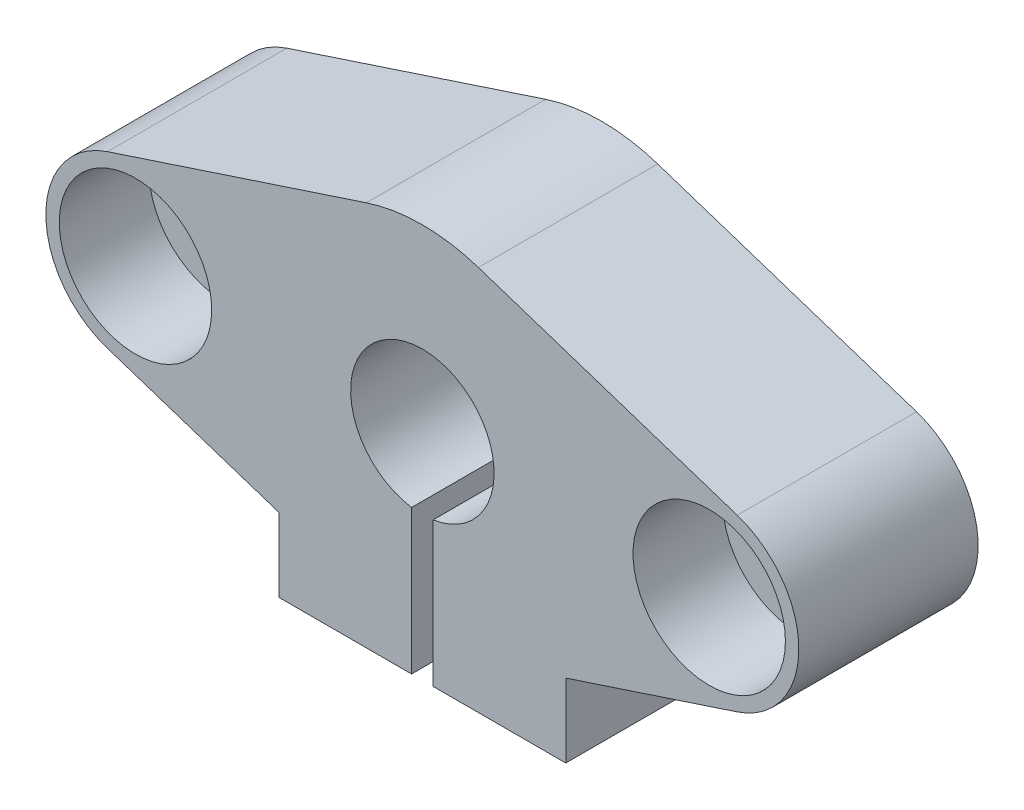
ISO-10303-21;
HEADER;
FILE_DESCRIPTION(('STEP AP214'),'2;1');
FILE_NAME('part.step','',(''),(''),'','','');
FILE_SCHEMA(('AUTOMOTIVE_DESIGN { 1 0 10303 214 1 1 1 1 }'));
ENDSEC;
DATA;
#1=APPLICATION_CONTEXT('core data for automotive mechanical design processes');
#2=APPLICATION_PROTOCOL_DEFINITION('international standard','automotive_design',2000,#1);
#3=PRODUCT_CONTEXT('',#1,'mechanical');
#4=PRODUCT('Part','Part','',(#3));
#5=PRODUCT_RELATED_PRODUCT_CATEGORY('part','',(#4));
#6=PRODUCT_DEFINITION_FORMATION('','',#4);
#7=PRODUCT_DEFINITION_CONTEXT('part definition',#1,'design');
#8=PRODUCT_DEFINITION('design','',#6,#7);
#9=PRODUCT_DEFINITION_SHAPE('','',#8);
#10=(LENGTH_UNIT() NAMED_UNIT(*) SI_UNIT(.MILLI.,.METRE.));
#11=(NAMED_UNIT(*) PLANE_ANGLE_UNIT() SI_UNIT($,.RADIAN.));
#12=(NAMED_UNIT(*) SI_UNIT($,.STERADIAN.) SOLID_ANGLE_UNIT());
#13=UNCERTAINTY_MEASURE_WITH_UNIT(LENGTH_MEASURE(1.E-05),#10,'distance_accuracy_value','');
#14=(GEOMETRIC_REPRESENTATION_CONTEXT(3) GLOBAL_UNCERTAINTY_ASSIGNED_CONTEXT((#13)) GLOBAL_UNIT_ASSIGNED_CONTEXT((#10,
#11,#12)) REPRESENTATION_CONTEXT('',''));
#15=CARTESIAN_POINT('',(0.,0.,0.));
#16=DIRECTION('',(0.,0.,1.));
#17=DIRECTION('',(1.,0.,0.));
#18=AXIS2_PLACEMENT_3D('',#15,#16,#17);
#19=CARTESIAN_POINT('',(0.,0.,5.));
#20=DIRECTION('',(0.,0.,1.));
#21=DIRECTION('',(1.,0.,0.));
#22=AXIS2_PLACEMENT_3D('',#19,#20,#21);
#23=PLANE('',#22);
#24=CARTESIAN_POINT('',(16.,0.,5.));
#25=DIRECTION('',(0.,0.,1.));
#26=DIRECTION('',(-1.,0.,0.));
#27=AXIS2_PLACEMENT_3D('',#24,#25,#26);
#28=CIRCLE('',#27,2.75);
#29=CARTESIAN_POINT('',(13.25,0.,5.));
#30=VERTEX_POINT('',#29);
#31=EDGE_CURVE('E369',#30,#30,#28,.T.);
#32=ORIENTED_EDGE('',*,*,#31,.F.);
#33=EDGE_LOOP('',(#32));
#34=FACE_BOUND('',#33,.T.);
#35=CARTESIAN_POINT('',(16.,0.,5.));
#36=DIRECTION('',(0.,0.,1.));
#37=DIRECTION('',(1.,0.,0.));
#38=AXIS2_PLACEMENT_3D('',#35,#36,#37);
#39=CIRCLE('',#38,4.25);
#40=CARTESIAN_POINT('',(20.25,0.,5.));
#41=VERTEX_POINT('',#40);
#42=EDGE_CURVE('E12',#41,#41,#39,.F.);
#43=ORIENTED_EDGE('',*,*,#42,.F.);
#44=EDGE_LOOP('',(#43));
#45=FACE_BOUND('',#44,.T.);
#46=ADVANCED_FACE('F111',(#34,#45),#23,.T.);
#47=CARTESIAN_POINT('',(8.,-6.00000000000001,10.));
#48=DIRECTION('',(1.,0.,0.));
#49=DIRECTION('',(0.,0.,-1.));
#50=AXIS2_PLACEMENT_3D('',#47,#48,#49);
#51=PLANE('',#50);
#52=DIRECTION('',(0.,0.,1.));
#53=VECTOR('',#52,1.);
#54=CARTESIAN_POINT('',(8.,-7.89542033951723,5.));
#55=LINE('',#54,#53);
#56=CARTESIAN_POINT('',(8.,-7.89542033951723,0.));
#57=VERTEX_POINT('',#56);
#58=CARTESIAN_POINT('',(8.,-7.89542033951723,10.));
#59=VERTEX_POINT('',#58);
#60=EDGE_CURVE('E127',#57,#59,#55,.T.);
#61=ORIENTED_EDGE('',*,*,#60,.T.);
#62=DIRECTION('',(0.,-1.,0.));
#63=VECTOR('',#62,1.);
#64=CARTESIAN_POINT('',(8.,-6.00000000000001,10.));
#65=LINE('',#64,#63);
#66=CARTESIAN_POINT('',(8.,-12.,10.));
#67=VERTEX_POINT('',#66);
#68=EDGE_CURVE('E235',#59,#67,#65,.T.);
#69=ORIENTED_EDGE('',*,*,#68,.T.);
#70=DIRECTION('',(0.,0.,-1.));
#71=VECTOR('',#70,1.);
#72=CARTESIAN_POINT('',(8.,-12.,10.));
#73=LINE('',#72,#71);
#74=CARTESIAN_POINT('',(8.,-12.,0.));
#75=VERTEX_POINT('',#74);
#76=EDGE_CURVE('E303',#67,#75,#73,.T.);
#77=ORIENTED_EDGE('',*,*,#76,.T.);
#78=DIRECTION('',(0.,-1.,0.));
#79=VECTOR('',#78,1.);
#80=CARTESIAN_POINT('',(8.,-6.00000000000001,0.));
#81=LINE('',#80,#79);
#82=EDGE_CURVE('E296',#57,#75,#81,.T.);
#83=ORIENTED_EDGE('',*,*,#82,.F.);
#84=EDGE_LOOP('',(#61,#69,#77,#83));
#85=FACE_BOUND('',#84,.T.);
#86=ADVANCED_FACE('F408',(#85),#51,.T.);
#87=CARTESIAN_POINT('',(0.,0.,10.));
#88=DIRECTION('',(0.,0.,-1.));
#89=DIRECTION('',(-1.,0.,0.));
#90=AXIS2_PLACEMENT_3D('',#87,#88,#89);
#91=CYLINDRICAL_SURFACE('',#90,10.);
#92=CARTESIAN_POINT('',(0.,0.,10.));
#93=DIRECTION('',(0.,0.,1.));
#94=DIRECTION('',(1.,0.,0.));
#95=AXIS2_PLACEMENT_3D('',#92,#93,#94);
#96=CIRCLE('',#95,10.);
#97=CARTESIAN_POINT('',(3.125,9.49917759598166,10.));
#98=VERTEX_POINT('',#97);
#99=CARTESIAN_POINT('',(-3.125,9.49917759598166,10.));
#100=VERTEX_POINT('',#99);
#101=EDGE_CURVE('E135',#98,#100,#96,.T.);
#102=ORIENTED_EDGE('',*,*,#101,.F.);
#103=DIRECTION('',(0.,0.,-1.));
#104=VECTOR('',#103,1.);
#105=CARTESIAN_POINT('',(3.125,9.49917759598166,5.));
#106=LINE('',#105,#104);
#107=CARTESIAN_POINT('',(3.125,9.49917759598166,0.));
#108=VERTEX_POINT('',#107);
#109=EDGE_CURVE('E227',#98,#108,#106,.T.);
#110=ORIENTED_EDGE('',*,*,#109,.T.);
#111=CARTESIAN_POINT('',(0.,0.,0.));
#112=DIRECTION('',(0.,0.,1.));
#113=DIRECTION('',(1.,0.,0.));
#114=AXIS2_PLACEMENT_3D('',#111,#112,#113);
#115=CIRCLE('',#114,10.);
#116=CARTESIAN_POINT('',(-3.125,9.49917759598166,0.));
#117=VERTEX_POINT('',#116);
#118=EDGE_CURVE('E346',#108,#117,#115,.T.);
#119=ORIENTED_EDGE('',*,*,#118,.T.);
#120=DIRECTION('',(0.,0.,-1.));
#121=VECTOR('',#120,1.);
#122=CARTESIAN_POINT('',(-3.125,9.49917759598166,5.));
#123=LINE('',#122,#121);
#124=EDGE_CURVE('E350',#100,#117,#123,.T.);
#125=ORIENTED_EDGE('',*,*,#124,.F.);
#126=EDGE_LOOP('',(#102,#110,#119,#125));
#127=FACE_BOUND('',#126,.T.);
#128=ADVANCED_FACE('F113',(#127),#91,.T.);
#129=CARTESIAN_POINT('',(0.,0.,5.));
#130=DIRECTION('',(0.,0.,1.));
#131=DIRECTION('',(1.,0.,0.));
#132=AXIS2_PLACEMENT_3D('',#129,#130,#131);
#133=PLANE('',#132);
#134=CARTESIAN_POINT('',(-16.,0.,5.));
#135=DIRECTION('',(0.,0.,1.));
#136=DIRECTION('',(1.,0.,0.));
#137=AXIS2_PLACEMENT_3D('',#134,#135,#136);
#138=CIRCLE('',#137,2.75);
#139=CARTESIAN_POINT('',(-13.25,0.,5.));
#140=VERTEX_POINT('',#139);
#141=EDGE_CURVE('E360',#140,#140,#138,.T.);
#142=ORIENTED_EDGE('',*,*,#141,.F.);
#143=EDGE_LOOP('',(#142));
#144=FACE_BOUND('',#143,.T.);
#145=CARTESIAN_POINT('',(-16.,0.,5.));
#146=DIRECTION('',(0.,0.,1.));
#147=DIRECTION('',(1.,0.,0.));
#148=AXIS2_PLACEMENT_3D('',#145,#146,#147);
#149=CIRCLE('',#148,4.25);
#150=CARTESIAN_POINT('',(-11.75,0.,5.));
#151=VERTEX_POINT('',#150);
#152=EDGE_CURVE('E120',#151,#151,#149,.F.);
#153=ORIENTED_EDGE('',*,*,#152,.F.);
#154=EDGE_LOOP('',(#153));
#155=FACE_BOUND('',#154,.T.);
#156=ADVANCED_FACE('F395',(#144,#155),#133,.T.);
#157=CARTESIAN_POINT('',(-8.,-6.00000000000001,10.));
#158=DIRECTION('',(1.,0.,0.));
#159=DIRECTION('',(0.,0.,-1.));
#160=AXIS2_PLACEMENT_3D('',#157,#158,#159);
#161=PLANE('',#160);
#162=DIRECTION('',(0.,-1.,0.));
#163=VECTOR('',#162,1.);
#164=CARTESIAN_POINT('',(-8.,-6.00000000000001,10.));
#165=LINE('',#164,#163);
#166=CARTESIAN_POINT('',(-8.,-7.89542033951723,10.));
#167=VERTEX_POINT('',#166);
#168=CARTESIAN_POINT('',(-8.,-12.,10.));
#169=VERTEX_POINT('',#168);
#170=EDGE_CURVE('E292',#167,#169,#165,.T.);
#171=ORIENTED_EDGE('',*,*,#170,.F.);
#172=DIRECTION('',(0.,0.,-1.));
#173=VECTOR('',#172,1.);
#174=CARTESIAN_POINT('',(-8.,-7.89542033951723,5.));
#175=LINE('',#174,#173);
#176=CARTESIAN_POINT('',(-8.,-7.89542033951723,0.));
#177=VERTEX_POINT('',#176);
#178=EDGE_CURVE('E387',#167,#177,#175,.T.);
#179=ORIENTED_EDGE('',*,*,#178,.T.);
#180=DIRECTION('',(0.,-1.,0.));
#181=VECTOR('',#180,1.);
#182=CARTESIAN_POINT('',(-8.,-6.00000000000001,0.));
#183=LINE('',#182,#181);
#184=CARTESIAN_POINT('',(-8.,-12.,0.));
#185=VERTEX_POINT('',#184);
#186=EDGE_CURVE('E291',#177,#185,#183,.T.);
#187=ORIENTED_EDGE('',*,*,#186,.T.);
#188=DIRECTION('',(0.,0.,-1.));
#189=VECTOR('',#188,1.);
#190=CARTESIAN_POINT('',(-8.,-12.,10.));
#191=LINE('',#190,#189);
#192=EDGE_CURVE('E317',#169,#185,#191,.T.);
#193=ORIENTED_EDGE('',*,*,#192,.F.);
#194=EDGE_LOOP('',(#171,#179,#187,#193));
#195=FACE_BOUND('',#194,.T.);
#196=ADVANCED_FACE('F397',(#195),#161,.F.);
#197=CARTESIAN_POINT('',(0.,0.,10.));
#198=DIRECTION('',(0.,0.,1.));
#199=DIRECTION('',(1.,0.,0.));
#200=AXIS2_PLACEMENT_3D('',#197,#198,#199);
#201=PLANE('',#200);
#202=DIRECTION('',(-0.949917759598166,0.3125,0.));
#203=VECTOR('',#202,1.);
#204=CARTESIAN_POINT('',(17.5625,4.74958879799083,10.));
#205=LINE('',#204,#203);
#206=CARTESIAN_POINT('',(17.5625,4.74958879799083,10.));
#207=VERTEX_POINT('',#206);
#208=EDGE_CURVE('E242',#207,#98,#205,.T.);
#209=ORIENTED_EDGE('',*,*,#208,.T.);
#210=ORIENTED_EDGE('',*,*,#101,.T.);
#211=DIRECTION('',(-0.949917759598166,-0.3125,0.));
#212=VECTOR('',#211,1.);
#213=CARTESIAN_POINT('',(-3.125,9.49917759598167,10.));
#214=LINE('',#213,#212);
#215=CARTESIAN_POINT('',(-17.5625,4.74958879799083,10.));
#216=VERTEX_POINT('',#215);
#217=EDGE_CURVE('E260',#100,#216,#214,.T.);
#218=ORIENTED_EDGE('',*,*,#217,.T.);
#219=CARTESIAN_POINT('',(-16.,0.,10.));
#220=DIRECTION('',(0.,0.,1.));
#221=DIRECTION('',(1.,0.,0.));
#222=AXIS2_PLACEMENT_3D('',#219,#220,#221);
#223=CIRCLE('',#222,5.);
#224=CARTESIAN_POINT('',(-17.5625,-4.74958879799083,10.));
#225=VERTEX_POINT('',#224);
#226=EDGE_CURVE('E252',#216,#225,#223,.T.);
#227=ORIENTED_EDGE('',*,*,#226,.T.);
#228=DIRECTION('',(0.949917759598166,-0.3125,0.));
#229=VECTOR('',#228,1.);
#230=CARTESIAN_POINT('',(-17.5625,-4.74958879799083,10.));
#231=LINE('',#230,#229);
#232=EDGE_CURVE('E256',#225,#167,#231,.T.);
#233=ORIENTED_EDGE('',*,*,#232,.T.);
#234=ORIENTED_EDGE('',*,*,#170,.T.);
#235=DIRECTION('',(1.,0.,0.));
#236=VECTOR('',#235,1.);
#237=CARTESIAN_POINT('',(-8.,-12.,10.));
#238=LINE('',#237,#236);
#239=CARTESIAN_POINT('',(-0.6,-12.,10.));
#240=VERTEX_POINT('',#239);
#241=EDGE_CURVE('E297',#169,#240,#238,.T.);
#242=ORIENTED_EDGE('',*,*,#241,.T.);
#243=DIRECTION('',(0.,-1.,0.));
#244=VECTOR('',#243,1.);
#245=CARTESIAN_POINT('',(-0.6,-3.95474398665704,10.));
#246=LINE('',#245,#244);
#247=CARTESIAN_POINT('',(-0.6,-3.95474398665704,10.));
#248=VERTEX_POINT('',#247);
#249=EDGE_CURVE('E264',#248,#240,#246,.T.);
#250=ORIENTED_EDGE('',*,*,#249,.F.);
#251=CARTESIAN_POINT('',(0.,0.,10.));
#252=DIRECTION('',(0.,0.,1.));
#253=DIRECTION('',(1.,0.,0.));
#254=AXIS2_PLACEMENT_3D('',#251,#252,#253);
#255=CIRCLE('',#254,4.);
#256=CARTESIAN_POINT('',(0.6,-3.95474398665704,10.));
#257=VERTEX_POINT('',#256);
#258=EDGE_CURVE('E376',#257,#248,#255,.T.);
#259=ORIENTED_EDGE('',*,*,#258,.F.);
#260=DIRECTION('',(0.,1.,0.));
#261=VECTOR('',#260,1.);
#262=CARTESIAN_POINT('',(0.6,-3.95474398665704,10.));
#263=LINE('',#262,#261);
#264=CARTESIAN_POINT('',(0.599999999999999,-12.,10.));
#265=VERTEX_POINT('',#264);
#266=EDGE_CURVE('E267',#265,#257,#263,.T.);
#267=ORIENTED_EDGE('',*,*,#266,.F.);
#268=EDGE_CURVE('E295',#265,#67,#238,.T.);
#269=ORIENTED_EDGE('',*,*,#268,.T.);
#270=ORIENTED_EDGE('',*,*,#68,.F.);
#271=DIRECTION('',(0.949917759598166,0.3125,0.));
#272=VECTOR('',#271,1.);
#273=CARTESIAN_POINT('',(8.,-7.89542033951723,10.));
#274=LINE('',#273,#272);
#275=CARTESIAN_POINT('',(17.5625,-4.74958879799083,10.));
#276=VERTEX_POINT('',#275);
#277=EDGE_CURVE('E217',#59,#276,#274,.T.);
#278=ORIENTED_EDGE('',*,*,#277,.T.);
#279=CARTESIAN_POINT('',(16.,0.,10.));
#280=DIRECTION('',(0.,0.,1.));
#281=DIRECTION('',(1.,0.,0.));
#282=AXIS2_PLACEMENT_3D('',#279,#280,#281);
#283=CIRCLE('',#282,5.);
#284=EDGE_CURVE('E232',#276,#207,#283,.T.);
#285=ORIENTED_EDGE('',*,*,#284,.T.);
#286=EDGE_LOOP('',(#209,#210,#218,#227,#233,#234,#242,#250,#259,#267,#269,#270,#278,#285));
#287=FACE_BOUND('',#286,.T.);
#288=CARTESIAN_POINT('',(-16.,0.,10.));
#289=DIRECTION('',(0.,0.,1.));
#290=DIRECTION('',(1.,0.,0.));
#291=AXIS2_PLACEMENT_3D('',#288,#289,#290);
#292=CIRCLE('',#291,4.25);
#293=CARTESIAN_POINT('',(-11.75,0.,10.));
#294=VERTEX_POINT('',#293);
#295=EDGE_CURVE('E245',#294,#294,#292,.T.);
#296=ORIENTED_EDGE('',*,*,#295,.F.);
#297=EDGE_LOOP('',(#296));
#298=FACE_BOUND('',#297,.T.);
#299=CARTESIAN_POINT('',(16.,0.,10.));
#300=DIRECTION('',(0.,0.,1.));
#301=DIRECTION('',(1.,0.,0.));
#302=AXIS2_PLACEMENT_3D('',#299,#300,#301);
#303=CIRCLE('',#302,4.25);
#304=CARTESIAN_POINT('',(20.25,0.,10.));
#305=VERTEX_POINT('',#304);
#306=EDGE_CURVE('E237',#305,#305,#303,.T.);
#307=ORIENTED_EDGE('',*,*,#306,.F.);
#308=EDGE_LOOP('',(#307));
#309=FACE_BOUND('',#308,.T.);
#310=ADVANCED_FACE('F230',(#287,#298,#309),#201,.T.);
#311=CARTESIAN_POINT('',(0.,0.,0.));
#312=DIRECTION('',(0.,0.,1.));
#313=DIRECTION('',(1.,0.,0.));
#314=AXIS2_PLACEMENT_3D('',#311,#312,#313);
#315=PLANE('',#314);
#316=CARTESIAN_POINT('',(16.,0.,0.));
#317=DIRECTION('',(0.,0.,1.));
#318=DIRECTION('',(-1.,0.,0.));
#319=AXIS2_PLACEMENT_3D('',#316,#317,#318);
#320=CIRCLE('',#319,2.75);
#321=CARTESIAN_POINT('',(13.25,0.,0.));
#322=VERTEX_POINT('',#321);
#323=EDGE_CURVE('E359',#322,#322,#320,.T.);
#324=ORIENTED_EDGE('',*,*,#323,.T.);
#325=EDGE_LOOP('',(#324));
#326=FACE_BOUND('',#325,.T.);
#327=CARTESIAN_POINT('',(-16.,0.,0.));
#328=DIRECTION('',(0.,0.,1.));
#329=DIRECTION('',(1.,0.,0.));
#330=AXIS2_PLACEMENT_3D('',#327,#328,#329);
#331=CIRCLE('',#330,2.75);
#332=CARTESIAN_POINT('',(-13.25,0.,0.));
#333=VERTEX_POINT('',#332);
#334=EDGE_CURVE('E365',#333,#333,#331,.T.);
#335=ORIENTED_EDGE('',*,*,#334,.T.);
#336=EDGE_LOOP('',(#335));
#337=FACE_BOUND('',#336,.T.);
#338=DIRECTION('',(0.,-1.,0.));
#339=VECTOR('',#338,1.);
#340=CARTESIAN_POINT('',(-0.6,-3.95474398665704,0.));
#341=LINE('',#340,#339);
#342=CARTESIAN_POINT('',(-0.6,-3.95474398665704,0.));
#343=VERTEX_POINT('',#342);
#344=CARTESIAN_POINT('',(-0.599999999999999,-12.,0.));
#345=VERTEX_POINT('',#344);
#346=EDGE_CURVE('E263',#343,#345,#341,.T.);
#347=ORIENTED_EDGE('',*,*,#346,.T.);
#348=DIRECTION('',(1.,0.,0.));
#349=VECTOR('',#348,1.);
#350=CARTESIAN_POINT('',(-8.,-12.,0.));
#351=LINE('',#350,#349);
#352=EDGE_CURVE('E307',#185,#345,#351,.T.);
#353=ORIENTED_EDGE('',*,*,#352,.F.);
#354=ORIENTED_EDGE('',*,*,#186,.F.);
#355=DIRECTION('',(0.949917759598166,-0.3125,0.));
#356=VECTOR('',#355,1.);
#357=CARTESIAN_POINT('',(-3.125,-9.49917759598166,0.));
#358=LINE('',#357,#356);
#359=CARTESIAN_POINT('',(-17.5625,-4.74958879799083,0.));
#360=VERTEX_POINT('',#359);
#361=EDGE_CURVE('E226',#360,#177,#358,.T.);
#362=ORIENTED_EDGE('',*,*,#361,.F.);
#363=CARTESIAN_POINT('',(-16.,0.,0.));
#364=DIRECTION('',(0.,0.,1.));
#365=DIRECTION('',(1.,0.,0.));
#366=AXIS2_PLACEMENT_3D('',#363,#364,#365);
#367=CIRCLE('',#366,5.);
#368=CARTESIAN_POINT('',(-17.5625,4.74958879799083,0.));
#369=VERTEX_POINT('',#368);
#370=EDGE_CURVE('E338',#369,#360,#367,.T.);
#371=ORIENTED_EDGE('',*,*,#370,.F.);
#372=DIRECTION('',(0.949917759598166,0.3125,0.));
#373=VECTOR('',#372,1.);
#374=CARTESIAN_POINT('',(-3.125,9.49917759598166,0.));
#375=LINE('',#374,#373);
#376=EDGE_CURVE('E342',#369,#117,#375,.T.);
#377=ORIENTED_EDGE('',*,*,#376,.T.);
#378=ORIENTED_EDGE('',*,*,#118,.F.);
#379=DIRECTION('',(-0.949917759598166,0.3125,0.));
#380=VECTOR('',#379,1.);
#381=CARTESIAN_POINT('',(3.125,9.49917759598166,0.));
#382=LINE('',#381,#380);
#383=CARTESIAN_POINT('',(17.5625,4.74958879799083,0.));
#384=VERTEX_POINT('',#383);
#385=EDGE_CURVE('E326',#384,#108,#382,.T.);
#386=ORIENTED_EDGE('',*,*,#385,.F.);
#387=CARTESIAN_POINT('',(16.,0.,0.));
#388=DIRECTION('',(0.,0.,1.));
#389=DIRECTION('',(1.,0.,0.));
#390=AXIS2_PLACEMENT_3D('',#387,#388,#389);
#391=CIRCLE('',#390,5.);
#392=CARTESIAN_POINT('',(17.5625,-4.74958879799083,0.));
#393=VERTEX_POINT('',#392);
#394=EDGE_CURVE('E321',#393,#384,#391,.T.);
#395=ORIENTED_EDGE('',*,*,#394,.F.);
#396=DIRECTION('',(-0.949917759598166,-0.3125,0.));
#397=VECTOR('',#396,1.);
#398=CARTESIAN_POINT('',(3.125,-9.49917759598166,0.));
#399=LINE('',#398,#397);
#400=EDGE_CURVE('E220',#393,#57,#399,.T.);
#401=ORIENTED_EDGE('',*,*,#400,.T.);
#402=ORIENTED_EDGE('',*,*,#82,.T.);
#403=CARTESIAN_POINT('',(0.6,-12.,0.));
#404=VERTEX_POINT('',#403);
#405=EDGE_CURVE('E306',#404,#75,#351,.T.);
#406=ORIENTED_EDGE('',*,*,#405,.F.);
#407=DIRECTION('',(0.,1.,0.));
#408=VECTOR('',#407,1.);
#409=CARTESIAN_POINT('',(0.6,-3.95474398665704,0.));
#410=LINE('',#409,#408);
#411=CARTESIAN_POINT('',(0.6,-3.95474398665704,0.));
#412=VERTEX_POINT('',#411);
#413=EDGE_CURVE('E268',#404,#412,#410,.T.);
#414=ORIENTED_EDGE('',*,*,#413,.T.);
#415=CARTESIAN_POINT('',(0.,0.,0.));
#416=DIRECTION('',(0.,0.,1.));
#417=DIRECTION('',(1.,0.,0.));
#418=AXIS2_PLACEMENT_3D('',#415,#416,#417);
#419=CIRCLE('',#418,4.);
#420=EDGE_CURVE('E364',#412,#343,#419,.T.);
#421=ORIENTED_EDGE('',*,*,#420,.T.);
#422=EDGE_LOOP('',(#347,#353,#354,#362,#371,#377,#378,#386,#395,#401,#402,#406,#414,#421));
#423=FACE_BOUND('',#422,.T.);
#424=ADVANCED_FACE('F481',(#326,#337,#423),#315,.F.);
#425=CARTESIAN_POINT('',(0.,0.,10.));
#426=DIRECTION('',(0.,0.,-1.));
#427=DIRECTION('',(-1.,0.,0.));
#428=AXIS2_PLACEMENT_3D('',#425,#426,#427);
#429=CYLINDRICAL_SURFACE('',#428,4.);
#430=ORIENTED_EDGE('',*,*,#258,.T.);
#431=DIRECTION('',(0.,0.,-1.));
#432=VECTOR('',#431,1.);
#433=CARTESIAN_POINT('',(-0.6,-3.95474398665704,10.));
#434=LINE('',#433,#432);
#435=EDGE_CURVE('E287',#248,#343,#434,.T.);
#436=ORIENTED_EDGE('',*,*,#435,.T.);
#437=ORIENTED_EDGE('',*,*,#420,.F.);
#438=DIRECTION('',(0.,0.,-1.));
#439=VECTOR('',#438,1.);
#440=CARTESIAN_POINT('',(0.6,-3.95474398665704,10.));
#441=LINE('',#440,#439);
#442=EDGE_CURVE('E271',#257,#412,#441,.T.);
#443=ORIENTED_EDGE('',*,*,#442,.F.);
#444=EDGE_LOOP('',(#430,#436,#437,#443));
#445=FACE_BOUND('',#444,.T.);
#446=ADVANCED_FACE('F456',(#445),#429,.F.);
#447=CARTESIAN_POINT('',(-8.,-12.,10.));
#448=DIRECTION('',(0.,1.,0.));
#449=DIRECTION('',(0.,0.,1.));
#450=AXIS2_PLACEMENT_3D('',#447,#448,#449);
#451=PLANE('',#450);
#452=DIRECTION('',(0.,0.,-1.));
#453=VECTOR('',#452,1.);
#454=CARTESIAN_POINT('',(-0.599999999999999,-12.,10.));
#455=LINE('',#454,#453);
#456=EDGE_CURVE('E284',#240,#345,#455,.T.);
#457=ORIENTED_EDGE('',*,*,#456,.F.);
#458=ORIENTED_EDGE('',*,*,#241,.F.);
#459=ORIENTED_EDGE('',*,*,#192,.T.);
#460=ORIENTED_EDGE('',*,*,#352,.T.);
#461=EDGE_LOOP('',(#457,#458,#459,#460));
#462=FACE_BOUND('',#461,.T.);
#463=ADVANCED_FACE('F454',(#462),#451,.F.);
#464=DIRECTION('',(0.,0.,-1.));
#465=VECTOR('',#464,1.);
#466=CARTESIAN_POINT('',(0.599999999999999,-12.,10.));
#467=LINE('',#466,#465);
#468=EDGE_CURVE('E280',#265,#404,#467,.T.);
#469=ORIENTED_EDGE('',*,*,#468,.T.);
#470=ORIENTED_EDGE('',*,*,#405,.T.);
#471=ORIENTED_EDGE('',*,*,#76,.F.);
#472=ORIENTED_EDGE('',*,*,#268,.F.);
#473=EDGE_LOOP('',(#469,#470,#471,#472));
#474=FACE_BOUND('',#473,.T.);
#475=ADVANCED_FACE('F436',(#474),#451,.F.);
#476=CARTESIAN_POINT('',(-3.125,-9.49917759598166,5.));
#477=DIRECTION('',(0.3125,0.949917759598166,0.));
#478=DIRECTION('',(-0.949917759598166,0.3125,0.));
#479=AXIS2_PLACEMENT_3D('',#476,#477,#478);
#480=PLANE('',#479);
#481=ORIENTED_EDGE('',*,*,#178,.F.);
#482=ORIENTED_EDGE('',*,*,#232,.F.);
#483=DIRECTION('',(0.,0.,-1.));
#484=VECTOR('',#483,1.);
#485=CARTESIAN_POINT('',(-17.5625,-4.74958879799083,5.));
#486=LINE('',#485,#484);
#487=EDGE_CURVE('E356',#225,#360,#486,.T.);
#488=ORIENTED_EDGE('',*,*,#487,.T.);
#489=ORIENTED_EDGE('',*,*,#361,.T.);
#490=EDGE_LOOP('',(#481,#482,#488,#489));
#491=FACE_BOUND('',#490,.T.);
#492=ADVANCED_FACE('F428',(#491),#480,.F.);
#493=CARTESIAN_POINT('',(16.,0.,5.));
#494=DIRECTION('',(0.,0.,-1.));
#495=DIRECTION('',(-1.,0.,0.));
#496=AXIS2_PLACEMENT_3D('',#493,#494,#495);
#497=CYLINDRICAL_SURFACE('',#496,2.75);
#498=ORIENTED_EDGE('',*,*,#31,.T.);
#499=EDGE_LOOP('',(#498));
#500=FACE_BOUND('',#499,.T.);
#501=ORIENTED_EDGE('',*,*,#323,.F.);
#502=EDGE_LOOP('',(#501));
#503=FACE_BOUND('',#502,.T.);
#504=ADVANCED_FACE('F424',(#500,#503),#497,.F.);
#505=CARTESIAN_POINT('',(-16.,0.,5.));
#506=DIRECTION('',(0.,0.,-1.));
#507=DIRECTION('',(-1.,0.,0.));
#508=AXIS2_PLACEMENT_3D('',#505,#506,#507);
#509=CYLINDRICAL_SURFACE('',#508,2.75);
#510=ORIENTED_EDGE('',*,*,#141,.T.);
#511=EDGE_LOOP('',(#510));
#512=FACE_BOUND('',#511,.T.);
#513=ORIENTED_EDGE('',*,*,#334,.F.);
#514=EDGE_LOOP('',(#513));
#515=FACE_BOUND('',#514,.T.);
#516=ADVANCED_FACE('F427',(#512,#515),#509,.F.);
#517=CARTESIAN_POINT('',(-16.,0.,5.));
#518=DIRECTION('',(0.,0.,-1.));
#519=DIRECTION('',(-1.,0.,0.));
#520=AXIS2_PLACEMENT_3D('',#517,#518,#519);
#521=CYLINDRICAL_SURFACE('',#520,5.);
#522=ORIENTED_EDGE('',*,*,#370,.T.);
#523=ORIENTED_EDGE('',*,*,#487,.F.);
#524=ORIENTED_EDGE('',*,*,#226,.F.);
#525=DIRECTION('',(0.,0.,-1.));
#526=VECTOR('',#525,1.);
#527=CARTESIAN_POINT('',(-17.5625,4.74958879799083,5.));
#528=LINE('',#527,#526);
#529=EDGE_CURVE('E353',#216,#369,#528,.T.);
#530=ORIENTED_EDGE('',*,*,#529,.T.);
#531=EDGE_LOOP('',(#522,#523,#524,#530));
#532=FACE_BOUND('',#531,.T.);
#533=ADVANCED_FACE('F432',(#532),#521,.T.);
#534=CARTESIAN_POINT('',(-3.125,9.49917759598166,5.));
#535=DIRECTION('',(-0.3125,0.949917759598166,0.));
#536=DIRECTION('',(-0.949917759598166,-0.3125,0.));
#537=AXIS2_PLACEMENT_3D('',#534,#535,#536);
#538=PLANE('',#537);
#539=ORIENTED_EDGE('',*,*,#376,.F.);
#540=ORIENTED_EDGE('',*,*,#529,.F.);
#541=ORIENTED_EDGE('',*,*,#217,.F.);
#542=ORIENTED_EDGE('',*,*,#124,.T.);
#543=EDGE_LOOP('',(#539,#540,#541,#542));
#544=FACE_BOUND('',#543,.T.);
#545=ADVANCED_FACE('F440',(#544),#538,.T.);
#546=CARTESIAN_POINT('',(16.,0.,5.));
#547=DIRECTION('',(0.,0.,-1.));
#548=DIRECTION('',(-1.,0.,0.));
#549=AXIS2_PLACEMENT_3D('',#546,#547,#548);
#550=CYLINDRICAL_SURFACE('',#549,5.);
#551=ORIENTED_EDGE('',*,*,#394,.T.);
#552=DIRECTION('',(0.,0.,-1.));
#553=VECTOR('',#552,1.);
#554=CARTESIAN_POINT('',(17.5625,4.74958879799083,5.));
#555=LINE('',#554,#553);
#556=EDGE_CURVE('E240',#207,#384,#555,.T.);
#557=ORIENTED_EDGE('',*,*,#556,.F.);
#558=ORIENTED_EDGE('',*,*,#284,.F.);
#559=DIRECTION('',(0.,0.,-1.));
#560=VECTOR('',#559,1.);
#561=CARTESIAN_POINT('',(17.5625,-4.74958879799083,5.));
#562=LINE('',#561,#560);
#563=EDGE_CURVE('E214',#276,#393,#562,.T.);
#564=ORIENTED_EDGE('',*,*,#563,.T.);
#565=EDGE_LOOP('',(#551,#557,#558,#564));
#566=FACE_BOUND('',#565,.T.);
#567=ADVANCED_FACE('F239',(#566),#550,.T.);
#568=CARTESIAN_POINT('',(3.125,-9.49917759598166,5.));
#569=DIRECTION('',(0.3125,-0.949917759598166,0.));
#570=DIRECTION('',(0.949917759598166,0.3125,0.));
#571=AXIS2_PLACEMENT_3D('',#568,#569,#570);
#572=PLANE('',#571);
#573=ORIENTED_EDGE('',*,*,#60,.F.);
#574=ORIENTED_EDGE('',*,*,#400,.F.);
#575=ORIENTED_EDGE('',*,*,#563,.F.);
#576=ORIENTED_EDGE('',*,*,#277,.F.);
#577=EDGE_LOOP('',(#573,#574,#575,#576));
#578=FACE_BOUND('',#577,.T.);
#579=ADVANCED_FACE('F216',(#578),#572,.T.);
#580=CARTESIAN_POINT('',(3.125,9.49917759598166,5.));
#581=DIRECTION('',(-0.3125,-0.949917759598166,0.));
#582=DIRECTION('',(0.949917759598166,-0.3125,0.));
#583=AXIS2_PLACEMENT_3D('',#580,#581,#582);
#584=PLANE('',#583);
#585=ORIENTED_EDGE('',*,*,#385,.T.);
#586=ORIENTED_EDGE('',*,*,#109,.F.);
#587=ORIENTED_EDGE('',*,*,#208,.F.);
#588=ORIENTED_EDGE('',*,*,#556,.T.);
#589=EDGE_LOOP('',(#585,#586,#587,#588));
#590=FACE_BOUND('',#589,.T.);
#591=ADVANCED_FACE('F449',(#590),#584,.F.);
#592=CARTESIAN_POINT('',(0.6,-3.95474398665704,10.));
#593=DIRECTION('',(-1.,0.,0.));
#594=DIRECTION('',(0.,-1.,0.));
#595=AXIS2_PLACEMENT_3D('',#592,#593,#594);
#596=PLANE('',#595);
#597=ORIENTED_EDGE('',*,*,#413,.F.);
#598=ORIENTED_EDGE('',*,*,#468,.F.);
#599=ORIENTED_EDGE('',*,*,#266,.T.);
#600=ORIENTED_EDGE('',*,*,#442,.T.);
#601=EDGE_LOOP('',(#597,#598,#599,#600));
#602=FACE_BOUND('',#601,.T.);
#603=ADVANCED_FACE('F451',(#602),#596,.T.);
#604=CARTESIAN_POINT('',(-0.6,-3.95474398665704,10.));
#605=DIRECTION('',(1.,0.,0.));
#606=DIRECTION('',(0.,1.,0.));
#607=AXIS2_PLACEMENT_3D('',#604,#605,#606);
#608=PLANE('',#607);
#609=ORIENTED_EDGE('',*,*,#346,.F.);
#610=ORIENTED_EDGE('',*,*,#435,.F.);
#611=ORIENTED_EDGE('',*,*,#249,.T.);
#612=ORIENTED_EDGE('',*,*,#456,.T.);
#613=EDGE_LOOP('',(#609,#610,#611,#612));
#614=FACE_BOUND('',#613,.T.);
#615=ADVANCED_FACE('F459',(#614),#608,.T.);
#616=CARTESIAN_POINT('',(-16.,0.,10.));
#617=DIRECTION('',(0.,0.,-1.));
#618=DIRECTION('',(-1.,0.,0.));
#619=AXIS2_PLACEMENT_3D('',#616,#617,#618);
#620=CYLINDRICAL_SURFACE('',#619,4.25);
#621=ORIENTED_EDGE('',*,*,#295,.T.);
#622=EDGE_LOOP('',(#621));
#623=FACE_BOUND('',#622,.T.);
#624=ORIENTED_EDGE('',*,*,#152,.T.);
#625=EDGE_LOOP('',(#624));
#626=FACE_BOUND('',#625,.T.);
#627=ADVANCED_FACE('F393',(#623,#626),#620,.F.);
#628=CARTESIAN_POINT('',(16.,0.,10.));
#629=DIRECTION('',(0.,0.,-1.));
#630=DIRECTION('',(-1.,0.,0.));
#631=AXIS2_PLACEMENT_3D('',#628,#629,#630);
#632=CYLINDRICAL_SURFACE('',#631,4.25);
#633=ORIENTED_EDGE('',*,*,#306,.T.);
#634=EDGE_LOOP('',(#633));
#635=FACE_BOUND('',#634,.T.);
#636=ORIENTED_EDGE('',*,*,#42,.T.);
#637=EDGE_LOOP('',(#636));
#638=FACE_BOUND('',#637,.T.);
#639=ADVANCED_FACE('F468',(#635,#638),#632,.F.);
#640=CLOSED_SHELL('',(#46,#86,#128,#156,#196,#310,#424,#446,#463,#475,#492,#504,#516,#533,#545,
#567,#579,#591,#603,#615,#627,#639));
#641=MANIFOLD_SOLID_BREP('B2',#640);
#642=ADVANCED_BREP_SHAPE_REPRESENTATION('',(#18,#641),#14);
#643=SHAPE_DEFINITION_REPRESENTATION(#9,#642);
ENDSEC;
END-ISO-10303-21;
